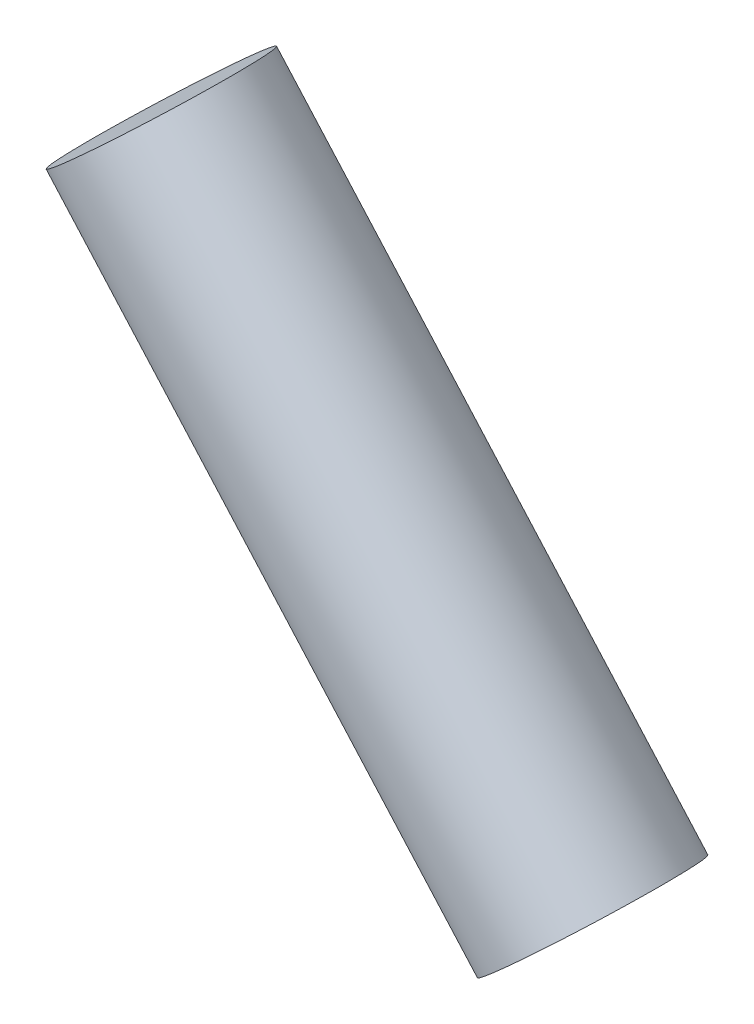
ISO-10303-21;
HEADER;
FILE_DESCRIPTION(('STEP AP214'),'2;1');
FILE_NAME('part.step','',(''),(''),'','','');
FILE_SCHEMA(('AUTOMOTIVE_DESIGN { 1 0 10303 214 1 1 1 1 }'));
ENDSEC;
DATA;
#1=APPLICATION_CONTEXT('core data for automotive mechanical design processes');
#2=APPLICATION_PROTOCOL_DEFINITION('international standard','automotive_design',2000,#1);
#3=PRODUCT_CONTEXT('',#1,'mechanical');
#4=PRODUCT('Part','Part','',(#3));
#5=PRODUCT_RELATED_PRODUCT_CATEGORY('part','',(#4));
#6=PRODUCT_DEFINITION_FORMATION('','',#4);
#7=PRODUCT_DEFINITION_CONTEXT('part definition',#1,'design');
#8=PRODUCT_DEFINITION('design','',#6,#7);
#9=PRODUCT_DEFINITION_SHAPE('','',#8);
#10=(LENGTH_UNIT() NAMED_UNIT(*) SI_UNIT(.MILLI.,.METRE.));
#11=(NAMED_UNIT(*) PLANE_ANGLE_UNIT() SI_UNIT($,.RADIAN.));
#12=(NAMED_UNIT(*) SI_UNIT($,.STERADIAN.) SOLID_ANGLE_UNIT());
#13=UNCERTAINTY_MEASURE_WITH_UNIT(LENGTH_MEASURE(1.E-05),#10,'distance_accuracy_value','');
#14=(GEOMETRIC_REPRESENTATION_CONTEXT(3) GLOBAL_UNCERTAINTY_ASSIGNED_CONTEXT((#13)) GLOBAL_UNIT_ASSIGNED_CONTEXT((#10,
#11,#12)) REPRESENTATION_CONTEXT('',''));
#15=CARTESIAN_POINT('',(0.,0.,0.));
#16=DIRECTION('',(0.,0.,1.));
#17=DIRECTION('',(1.,0.,0.));
#18=AXIS2_PLACEMENT_3D('',#15,#16,#17);
#19=CARTESIAN_POINT('',(86.0329729318253,-31.0876336917629,-27.368377284982));
#20=DIRECTION('',(0.664699798962186,-0.747110552234159,0.));
#21=DIRECTION('',(0.747110552234159,0.664699798962186,0.));
#22=AXIS2_PLACEMENT_3D('',#19,#20,#21);
#23=PLANE('',#22);
#24=CARTESIAN_POINT('',(86.0329729318255,-31.0876336917631,-27.368377284982));
#25=DIRECTION('',(-0.664699798962185,0.747110552234159,0.));
#26=DIRECTION('',(-0.747110552234159,-0.664699798962185,0.));
#27=AXIS2_PLACEMENT_3D('',#24,#25,#26);
#28=CIRCLE('',#27,2.3495);
#29=CARTESIAN_POINT('',(84.2776366893513,-32.6493458694248,-27.368377284982));
#30=VERTEX_POINT('',#29);
#31=EDGE_CURVE('E17',#30,#30,#28,.T.);
#32=ORIENTED_EDGE('',*,*,#31,.F.);
#33=EDGE_LOOP('',(#32));
#34=FACE_BOUND('',#33,.T.);
#35=ADVANCED_FACE('F14',(#34),#23,.T.);
#36=CARTESIAN_POINT('',(75.0587792509599,-18.752838474377,-27.368377284982));
#37=DIRECTION('',(0.664699798962186,-0.747110552234159,0.));
#38=DIRECTION('',(0.747110552234159,0.664699798962186,0.));
#39=AXIS2_PLACEMENT_3D('',#36,#37,#38);
#40=PLANE('',#39);
#41=CARTESIAN_POINT('',(75.0587792509597,-18.7528384743771,-27.368377284982));
#42=DIRECTION('',(-0.664699798962185,0.747110552234159,0.));
#43=DIRECTION('',(-0.747110552234159,-0.664699798962185,0.));
#44=AXIS2_PLACEMENT_3D('',#41,#42,#43);
#45=CIRCLE('',#44,2.3495);
#46=CARTESIAN_POINT('',(73.3034430084856,-20.3145506520387,-27.368377284982));
#47=VERTEX_POINT('',#46);
#48=EDGE_CURVE('E10',#47,#47,#45,.F.);
#49=ORIENTED_EDGE('',*,*,#48,.F.);
#50=EDGE_LOOP('',(#49));
#51=FACE_BOUND('',#50,.T.);
#52=ADVANCED_FACE('F29',(#51),#40,.F.);
#53=CARTESIAN_POINT('',(86.0329729318253,-31.0876336917629,-27.368377284982));
#54=DIRECTION('',(-0.664699798962185,0.747110552234159,0.));
#55=DIRECTION('',(-0.747110552234159,-0.664699798962185,0.));
#56=AXIS2_PLACEMENT_3D('',#53,#54,#55);
#57=CYLINDRICAL_SURFACE('',#56,2.3495);
#58=ORIENTED_EDGE('',*,*,#48,.T.);
#59=EDGE_LOOP('',(#58));
#60=FACE_BOUND('',#59,.T.);
#61=ORIENTED_EDGE('',*,*,#31,.T.);
#62=EDGE_LOOP('',(#61));
#63=FACE_BOUND('',#62,.T.);
#64=ADVANCED_FACE('F26',(#60,#63),#57,.T.);
#65=CLOSED_SHELL('',(#35,#52,#64));
#66=MANIFOLD_SOLID_BREP('B1',#65);
#67=ADVANCED_BREP_SHAPE_REPRESENTATION('',(#18,#66),#14);
#68=SHAPE_DEFINITION_REPRESENTATION(#9,#67);
ENDSEC;
END-ISO-10303-21;
